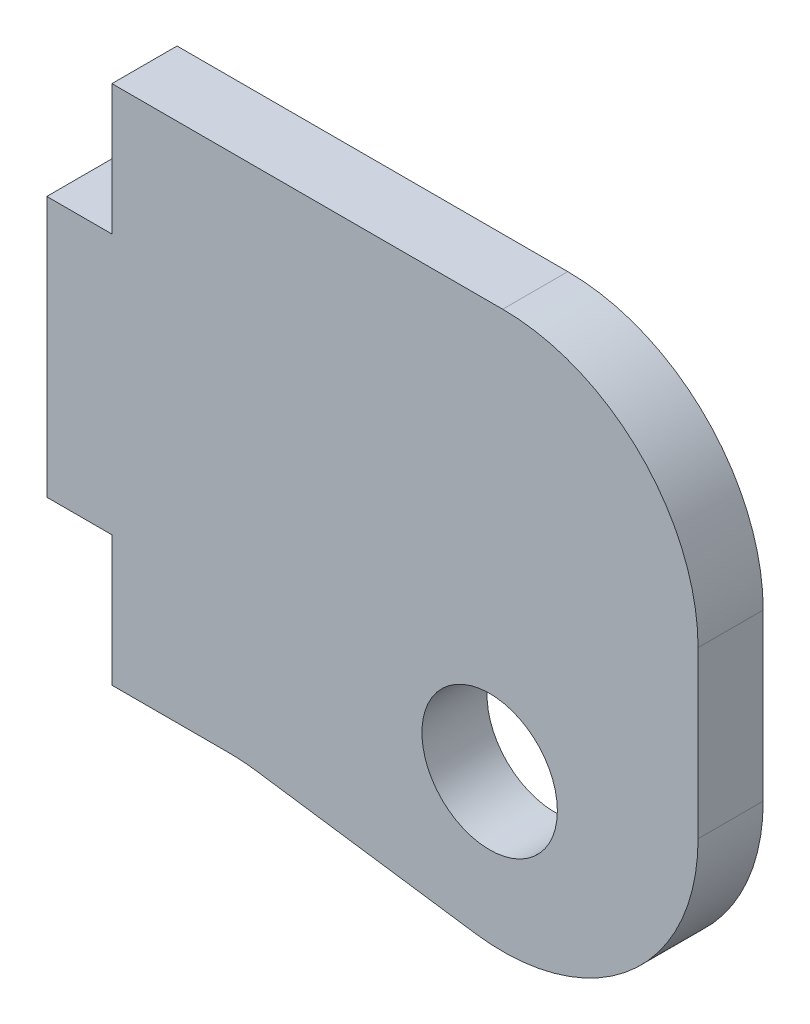
ISO-10303-21;
HEADER;
FILE_DESCRIPTION(('STEP AP214'),'2;1');
FILE_NAME('part.step','',(''),(''),'','','');
FILE_SCHEMA(('AUTOMOTIVE_DESIGN { 1 0 10303 214 1 1 1 1 }'));
ENDSEC;
DATA;
#1=APPLICATION_CONTEXT('core data for automotive mechanical design processes');
#2=APPLICATION_PROTOCOL_DEFINITION('international standard','automotive_design',2000,#1);
#3=PRODUCT_CONTEXT('',#1,'mechanical');
#4=PRODUCT('Part','Part','',(#3));
#5=PRODUCT_RELATED_PRODUCT_CATEGORY('part','',(#4));
#6=PRODUCT_DEFINITION_FORMATION('','',#4);
#7=PRODUCT_DEFINITION_CONTEXT('part definition',#1,'design');
#8=PRODUCT_DEFINITION('design','',#6,#7);
#9=PRODUCT_DEFINITION_SHAPE('','',#8);
#10=(LENGTH_UNIT() NAMED_UNIT(*) SI_UNIT(.MILLI.,.METRE.));
#11=(NAMED_UNIT(*) PLANE_ANGLE_UNIT() SI_UNIT($,.RADIAN.));
#12=(NAMED_UNIT(*) SI_UNIT($,.STERADIAN.) SOLID_ANGLE_UNIT());
#13=UNCERTAINTY_MEASURE_WITH_UNIT(LENGTH_MEASURE(1.E-05),#10,'distance_accuracy_value','');
#14=(GEOMETRIC_REPRESENTATION_CONTEXT(3) GLOBAL_UNCERTAINTY_ASSIGNED_CONTEXT((#13)) GLOBAL_UNIT_ASSIGNED_CONTEXT((#10,
#11,#12)) REPRESENTATION_CONTEXT('',''));
#15=CARTESIAN_POINT('',(0.,0.,0.));
#16=DIRECTION('',(0.,0.,1.));
#17=DIRECTION('',(1.,0.,0.));
#18=AXIS2_PLACEMENT_3D('',#15,#16,#17);
#19=CARTESIAN_POINT('',(31.75,12.7,3.175));
#20=DIRECTION('',(0.,-1.,0.));
#21=DIRECTION('',(1.,0.,0.));
#22=AXIS2_PLACEMENT_3D('',#19,#20,#21);
#23=PLANE('',#22);
#24=DIRECTION('',(-1.,0.,0.));
#25=VECTOR('',#24,1.);
#26=CARTESIAN_POINT('',(31.75,12.7,0.));
#27=LINE('',#26,#25);
#28=CARTESIAN_POINT('',(22.225,12.7,0.));
#29=VERTEX_POINT('',#28);
#30=CARTESIAN_POINT('',(3.175,12.7,0.));
#31=VERTEX_POINT('',#30);
#32=EDGE_CURVE('E151',#29,#31,#27,.T.);
#33=ORIENTED_EDGE('',*,*,#32,.T.);
#34=DIRECTION('',(0.,0.,1.));
#35=VECTOR('',#34,1.);
#36=CARTESIAN_POINT('',(3.175,12.7,0.));
#37=LINE('',#36,#35);
#38=CARTESIAN_POINT('',(3.175,12.7,3.175));
#39=VERTEX_POINT('',#38);
#40=EDGE_CURVE('E198',#31,#39,#37,.T.);
#41=ORIENTED_EDGE('',*,*,#40,.T.);
#42=DIRECTION('',(-1.,0.,0.));
#43=VECTOR('',#42,1.);
#44=CARTESIAN_POINT('',(31.75,12.7,3.175));
#45=LINE('',#44,#43);
#46=CARTESIAN_POINT('',(22.225,12.7,3.175));
#47=VERTEX_POINT('',#46);
#48=EDGE_CURVE('E157',#47,#39,#45,.T.);
#49=ORIENTED_EDGE('',*,*,#48,.F.);
#50=DIRECTION('',(0.,0.,-1.));
#51=VECTOR('',#50,1.);
#52=CARTESIAN_POINT('',(22.225,12.7,3.175));
#53=LINE('',#52,#51);
#54=EDGE_CURVE('E166',#47,#29,#53,.T.);
#55=ORIENTED_EDGE('',*,*,#54,.T.);
#56=EDGE_LOOP('',(#33,#41,#49,#55));
#57=FACE_BOUND('',#56,.T.);
#58=ADVANCED_FACE('F35',(#57),#23,.F.);
#59=CARTESIAN_POINT('',(0.,12.7,3.175));
#60=DIRECTION('',(1.,0.,0.));
#61=DIRECTION('',(0.,1.,0.));
#62=AXIS2_PLACEMENT_3D('',#59,#60,#61);
#63=PLANE('',#62);
#64=DIRECTION('',(0.,-1.,0.));
#65=VECTOR('',#64,1.);
#66=CARTESIAN_POINT('',(0.,12.7,0.));
#67=LINE('',#66,#65);
#68=CARTESIAN_POINT('',(0.,6.35000000000001,0.));
#69=VERTEX_POINT('',#68);
#70=CARTESIAN_POINT('',(0.,-6.34999999999999,0.));
#71=VERTEX_POINT('',#70);
#72=EDGE_CURVE('E145',#69,#71,#67,.T.);
#73=ORIENTED_EDGE('',*,*,#72,.T.);
#74=DIRECTION('',(0.,0.,1.));
#75=VECTOR('',#74,1.);
#76=CARTESIAN_POINT('',(0.,-6.34999999999999,0.));
#77=LINE('',#76,#75);
#78=CARTESIAN_POINT('',(0.,-6.34999999999999,3.175));
#79=VERTEX_POINT('',#78);
#80=EDGE_CURVE('E231',#71,#79,#77,.T.);
#81=ORIENTED_EDGE('',*,*,#80,.T.);
#82=DIRECTION('',(0.,-1.,0.));
#83=VECTOR('',#82,1.);
#84=CARTESIAN_POINT('',(0.,12.7,3.175));
#85=LINE('',#84,#83);
#86=CARTESIAN_POINT('',(0.,6.35000000000001,3.175));
#87=VERTEX_POINT('',#86);
#88=EDGE_CURVE('E199',#87,#79,#85,.T.);
#89=ORIENTED_EDGE('',*,*,#88,.F.);
#90=DIRECTION('',(0.,0.,1.));
#91=VECTOR('',#90,1.);
#92=CARTESIAN_POINT('',(0.,6.35000000000001,0.));
#93=LINE('',#92,#91);
#94=EDGE_CURVE('E234',#69,#87,#93,.T.);
#95=ORIENTED_EDGE('',*,*,#94,.F.);
#96=EDGE_LOOP('',(#73,#81,#89,#95));
#97=FACE_BOUND('',#96,.T.);
#98=ADVANCED_FACE('F256',(#97),#63,.F.);
#99=CARTESIAN_POINT('',(0.,-12.7,3.175));
#100=DIRECTION('',(0.,1.,0.));
#101=DIRECTION('',(-1.,0.,0.));
#102=AXIS2_PLACEMENT_3D('',#99,#100,#101);
#103=PLANE('',#102);
#104=DIRECTION('',(1.,0.,0.));
#105=VECTOR('',#104,1.);
#106=CARTESIAN_POINT('',(0.,-12.7,3.175));
#107=LINE('',#106,#105);
#108=CARTESIAN_POINT('',(3.175,-12.7,3.175));
#109=VERTEX_POINT('',#108);
#110=CARTESIAN_POINT('',(8.84807909198137,-12.7,3.175));
#111=VERTEX_POINT('',#110);
#112=EDGE_CURVE('E139',#109,#111,#107,.T.);
#113=ORIENTED_EDGE('',*,*,#112,.F.);
#114=DIRECTION('',(0.,0.,1.));
#115=VECTOR('',#114,1.);
#116=CARTESIAN_POINT('',(3.175,-12.7,0.));
#117=LINE('',#116,#115);
#118=CARTESIAN_POINT('',(3.175,-12.7,0.));
#119=VERTEX_POINT('',#118);
#120=EDGE_CURVE('E126',#119,#109,#117,.T.);
#121=ORIENTED_EDGE('',*,*,#120,.F.);
#122=DIRECTION('',(1.,0.,0.));
#123=VECTOR('',#122,1.);
#124=CARTESIAN_POINT('',(0.,-12.7,0.));
#125=LINE('',#124,#123);
#126=CARTESIAN_POINT('',(8.84807909198137,-12.7,0.));
#127=VERTEX_POINT('',#126);
#128=EDGE_CURVE('E137',#119,#127,#125,.T.);
#129=ORIENTED_EDGE('',*,*,#128,.T.);
#130=DIRECTION('',(0.,0.,-1.));
#131=VECTOR('',#130,1.);
#132=CARTESIAN_POINT('',(8.84807909198137,-12.7,3.175));
#133=LINE('',#132,#131);
#134=EDGE_CURVE('E164',#127,#111,#133,.F.);
#135=ORIENTED_EDGE('',*,*,#134,.T.);
#136=EDGE_LOOP('',(#113,#121,#129,#135));
#137=FACE_BOUND('',#136,.T.);
#138=ADVANCED_FACE('F135',(#137),#103,.F.);
#139=CARTESIAN_POINT('',(9.525,-12.7,3.175));
#140=DIRECTION('',(0.141421356237309,0.989949493661167,0.));
#141=DIRECTION('',(-0.989949493661167,0.141421356237309,0.));
#142=AXIS2_PLACEMENT_3D('',#139,#140,#141);
#143=PLANE('',#142);
#144=DIRECTION('',(0.989949493661167,-0.141421356237309,0.));
#145=VECTOR('',#144,1.);
#146=CARTESIAN_POINT('',(9.525,-12.7,3.175));
#147=LINE('',#146,#145);
#148=CARTESIAN_POINT('',(10.1951175101417,-12.7957310728774,3.175));
#149=VERTEX_POINT('',#148);
#150=CARTESIAN_POINT('',(20.8779615818396,-14.3218516545485,3.175));
#151=VERTEX_POINT('',#150);
#152=EDGE_CURVE('E214',#149,#151,#147,.T.);
#153=ORIENTED_EDGE('',*,*,#152,.F.);
#154=DIRECTION('',(0.,0.,-1.));
#155=VECTOR('',#154,1.);
#156=CARTESIAN_POINT('',(10.1951175101417,-12.7957310728774,0.));
#157=LINE('',#156,#155);
#158=CARTESIAN_POINT('',(10.1951175101417,-12.7957310728774,0.));
#159=VERTEX_POINT('',#158);
#160=EDGE_CURVE('E160',#149,#159,#157,.T.);
#161=ORIENTED_EDGE('',*,*,#160,.T.);
#162=DIRECTION('',(0.989949493661167,-0.141421356237309,0.));
#163=VECTOR('',#162,1.);
#164=CARTESIAN_POINT('',(9.525,-12.7,0.));
#165=LINE('',#164,#163);
#166=CARTESIAN_POINT('',(20.8779615818396,-14.3218516545485,0.));
#167=VERTEX_POINT('',#166);
#168=EDGE_CURVE('E144',#159,#167,#165,.T.);
#169=ORIENTED_EDGE('',*,*,#168,.T.);
#170=DIRECTION('',(0.,0.,-1.));
#171=VECTOR('',#170,1.);
#172=CARTESIAN_POINT('',(20.8779615818396,-14.3218516545485,3.175));
#173=LINE('',#172,#171);
#174=EDGE_CURVE('E158',#167,#151,#173,.F.);
#175=ORIENTED_EDGE('',*,*,#174,.T.);
#176=EDGE_LOOP('',(#153,#161,#169,#175));
#177=FACE_BOUND('',#176,.T.);
#178=ADVANCED_FACE('F211',(#177),#143,.F.);
#179=CARTESIAN_POINT('',(31.75,-15.875,3.175));
#180=DIRECTION('',(-1.,0.,0.));
#181=DIRECTION('',(0.,-1.,0.));
#182=AXIS2_PLACEMENT_3D('',#179,#180,#181);
#183=PLANE('',#182);
#184=DIRECTION('',(0.,1.,0.));
#185=VECTOR('',#184,1.);
#186=CARTESIAN_POINT('',(31.75,-15.875,0.));
#187=LINE('',#186,#185);
#188=CARTESIAN_POINT('',(31.75,-4.8925827274259,0.));
#189=VERTEX_POINT('',#188);
#190=CARTESIAN_POINT('',(31.75,3.17500000000001,0.));
#191=VERTEX_POINT('',#190);
#192=EDGE_CURVE('E148',#189,#191,#187,.T.);
#193=ORIENTED_EDGE('',*,*,#192,.T.);
#194=DIRECTION('',(0.,0.,-1.));
#195=VECTOR('',#194,1.);
#196=CARTESIAN_POINT('',(31.75,3.17500000000001,3.175));
#197=LINE('',#196,#195);
#198=CARTESIAN_POINT('',(31.75,3.17500000000001,3.175));
#199=VERTEX_POINT('',#198);
#200=EDGE_CURVE('E176',#191,#199,#197,.F.);
#201=ORIENTED_EDGE('',*,*,#200,.T.);
#202=DIRECTION('',(0.,1.,0.));
#203=VECTOR('',#202,1.);
#204=CARTESIAN_POINT('',(31.75,-15.875,3.175));
#205=LINE('',#204,#203);
#206=CARTESIAN_POINT('',(31.75,-4.8925827274259,3.175));
#207=VERTEX_POINT('',#206);
#208=EDGE_CURVE('E161',#207,#199,#205,.T.);
#209=ORIENTED_EDGE('',*,*,#208,.F.);
#210=DIRECTION('',(0.,0.,-1.));
#211=VECTOR('',#210,1.);
#212=CARTESIAN_POINT('',(31.75,-4.8925827274259,3.175));
#213=LINE('',#212,#211);
#214=EDGE_CURVE('E173',#207,#189,#213,.T.);
#215=ORIENTED_EDGE('',*,*,#214,.T.);
#216=EDGE_LOOP('',(#193,#201,#209,#215));
#217=FACE_BOUND('',#216,.T.);
#218=ADVANCED_FACE('F204',(#217),#183,.F.);
#219=CARTESIAN_POINT('',(0.,0.,3.175));
#220=DIRECTION('',(0.,0.,1.));
#221=DIRECTION('',(1.,0.,0.));
#222=AXIS2_PLACEMENT_3D('',#219,#220,#221);
#223=PLANE('',#222);
#224=DIRECTION('',(-1.,0.,0.));
#225=VECTOR('',#224,1.);
#226=CARTESIAN_POINT('',(0.,-6.34999999999999,3.175));
#227=LINE('',#226,#225);
#228=CARTESIAN_POINT('',(3.175,-6.34999999999999,3.175));
#229=VERTEX_POINT('',#228);
#230=EDGE_CURVE('E131',#229,#79,#227,.T.);
#231=ORIENTED_EDGE('',*,*,#230,.F.);
#232=DIRECTION('',(0.,1.,0.));
#233=VECTOR('',#232,1.);
#234=CARTESIAN_POINT('',(3.175,-12.7,3.175));
#235=LINE('',#234,#233);
#236=EDGE_CURVE('E218',#109,#229,#235,.T.);
#237=ORIENTED_EDGE('',*,*,#236,.F.);
#238=ORIENTED_EDGE('',*,*,#112,.T.);
#239=CARTESIAN_POINT('',(8.84807909198136,-22.225,3.175));
#240=DIRECTION('',(0.,0.,1.));
#241=DIRECTION('',(1.,0.,0.));
#242=AXIS2_PLACEMENT_3D('',#239,#240,#241);
#243=CIRCLE('',#242,9.525);
#244=EDGE_CURVE('E11',#111,#149,#243,.F.);
#245=ORIENTED_EDGE('',*,*,#244,.T.);
#246=ORIENTED_EDGE('',*,*,#152,.T.);
#247=CARTESIAN_POINT('',(22.225,-4.8925827274259,3.175));
#248=DIRECTION('',(0.,0.,1.));
#249=DIRECTION('',(1.,0.,0.));
#250=AXIS2_PLACEMENT_3D('',#247,#248,#249);
#251=CIRCLE('',#250,9.525);
#252=EDGE_CURVE('E178',#151,#207,#251,.T.);
#253=ORIENTED_EDGE('',*,*,#252,.T.);
#254=ORIENTED_EDGE('',*,*,#208,.T.);
#255=CARTESIAN_POINT('',(22.225,3.17500000000001,3.175));
#256=DIRECTION('',(0.,0.,1.));
#257=DIRECTION('',(1.,0.,0.));
#258=AXIS2_PLACEMENT_3D('',#255,#256,#257);
#259=CIRCLE('',#258,9.525);
#260=EDGE_CURVE('E180',#199,#47,#259,.T.);
#261=ORIENTED_EDGE('',*,*,#260,.T.);
#262=ORIENTED_EDGE('',*,*,#48,.T.);
#263=DIRECTION('',(0.,1.,0.));
#264=VECTOR('',#263,1.);
#265=CARTESIAN_POINT('',(3.175,12.7,3.175));
#266=LINE('',#265,#264);
#267=CARTESIAN_POINT('',(3.175,6.35000000000001,3.175));
#268=VERTEX_POINT('',#267);
#269=EDGE_CURVE('E239',#268,#39,#266,.T.);
#270=ORIENTED_EDGE('',*,*,#269,.F.);
#271=DIRECTION('',(1.,0.,0.));
#272=VECTOR('',#271,1.);
#273=CARTESIAN_POINT('',(0.,6.35000000000001,3.175));
#274=LINE('',#273,#272);
#275=EDGE_CURVE('E242',#87,#268,#274,.T.);
#276=ORIENTED_EDGE('',*,*,#275,.F.);
#277=ORIENTED_EDGE('',*,*,#88,.T.);
#278=EDGE_LOOP('',(#231,#237,#238,#245,#246,#253,#254,#261,#262,#270,#276,#277));
#279=FACE_BOUND('',#278,.T.);
#280=CARTESIAN_POINT('',(21.5882999780113,-7.14087159890308,3.175));
#281=DIRECTION('',(0.,0.,1.));
#282=DIRECTION('',(1.,0.,0.));
#283=AXIS2_PLACEMENT_3D('',#280,#281,#282);
#284=CIRCLE('',#283,3.302);
#285=CARTESIAN_POINT('',(24.8902999780113,-7.14087159890308,3.175));
#286=VERTEX_POINT('',#285);
#287=EDGE_CURVE('E226',#286,#286,#284,.T.);
#288=ORIENTED_EDGE('',*,*,#287,.F.);
#289=EDGE_LOOP('',(#288));
#290=FACE_BOUND('',#289,.T.);
#291=ADVANCED_FACE('F187',(#279,#290),#223,.T.);
#292=CARTESIAN_POINT('',(0.,0.,0.));
#293=DIRECTION('',(0.,0.,1.));
#294=DIRECTION('',(1.,0.,0.));
#295=AXIS2_PLACEMENT_3D('',#292,#293,#294);
#296=PLANE('',#295);
#297=CARTESIAN_POINT('',(21.5882999780113,-7.14087159890308,0.));
#298=DIRECTION('',(0.,0.,1.));
#299=DIRECTION('',(1.,0.,0.));
#300=AXIS2_PLACEMENT_3D('',#297,#298,#299);
#301=CIRCLE('',#300,3.302);
#302=CARTESIAN_POINT('',(24.8902999780113,-7.14087159890308,0.));
#303=VERTEX_POINT('',#302);
#304=EDGE_CURVE('E224',#303,#303,#301,.T.);
#305=ORIENTED_EDGE('',*,*,#304,.T.);
#306=EDGE_LOOP('',(#305));
#307=FACE_BOUND('',#306,.T.);
#308=DIRECTION('',(0.,1.,0.));
#309=VECTOR('',#308,1.);
#310=CARTESIAN_POINT('',(3.175,-12.7,0.));
#311=LINE('',#310,#309);
#312=CARTESIAN_POINT('',(3.175,-6.34999999999999,0.));
#313=VERTEX_POINT('',#312);
#314=EDGE_CURVE('E122',#119,#313,#311,.T.);
#315=ORIENTED_EDGE('',*,*,#314,.T.);
#316=DIRECTION('',(-1.,0.,0.));
#317=VECTOR('',#316,1.);
#318=CARTESIAN_POINT('',(0.,-6.34999999999999,0.));
#319=LINE('',#318,#317);
#320=EDGE_CURVE('E50',#313,#71,#319,.T.);
#321=ORIENTED_EDGE('',*,*,#320,.T.);
#322=ORIENTED_EDGE('',*,*,#72,.F.);
#323=DIRECTION('',(1.,0.,0.));
#324=VECTOR('',#323,1.);
#325=CARTESIAN_POINT('',(0.,6.35000000000001,0.));
#326=LINE('',#325,#324);
#327=CARTESIAN_POINT('',(3.175,6.35000000000001,0.));
#328=VERTEX_POINT('',#327);
#329=EDGE_CURVE('E241',#69,#328,#326,.T.);
#330=ORIENTED_EDGE('',*,*,#329,.T.);
#331=DIRECTION('',(0.,1.,0.));
#332=VECTOR('',#331,1.);
#333=CARTESIAN_POINT('',(3.175,12.7,0.));
#334=LINE('',#333,#332);
#335=EDGE_CURVE('E58',#328,#31,#334,.T.);
#336=ORIENTED_EDGE('',*,*,#335,.T.);
#337=ORIENTED_EDGE('',*,*,#32,.F.);
#338=CARTESIAN_POINT('',(22.225,3.17500000000001,0.));
#339=DIRECTION('',(0.,0.,1.));
#340=DIRECTION('',(1.,0.,0.));
#341=AXIS2_PLACEMENT_3D('',#338,#339,#340);
#342=CIRCLE('',#341,9.525);
#343=EDGE_CURVE('E171',#29,#191,#342,.F.);
#344=ORIENTED_EDGE('',*,*,#343,.T.);
#345=ORIENTED_EDGE('',*,*,#192,.F.);
#346=CARTESIAN_POINT('',(22.225,-4.8925827274259,0.));
#347=DIRECTION('',(0.,0.,1.));
#348=DIRECTION('',(1.,0.,0.));
#349=AXIS2_PLACEMENT_3D('',#346,#347,#348);
#350=CIRCLE('',#349,9.525);
#351=EDGE_CURVE('E169',#189,#167,#350,.F.);
#352=ORIENTED_EDGE('',*,*,#351,.T.);
#353=ORIENTED_EDGE('',*,*,#168,.F.);
#354=CARTESIAN_POINT('',(8.84807909198136,-22.225,0.));
#355=DIRECTION('',(0.,0.,1.));
#356=DIRECTION('',(1.,0.,0.));
#357=AXIS2_PLACEMENT_3D('',#354,#355,#356);
#358=CIRCLE('',#357,9.525);
#359=EDGE_CURVE('E43',#159,#127,#358,.T.);
#360=ORIENTED_EDGE('',*,*,#359,.T.);
#361=ORIENTED_EDGE('',*,*,#128,.F.);
#362=EDGE_LOOP('',(#315,#321,#322,#330,#336,#337,#344,#345,#352,#353,#360,#361));
#363=FACE_BOUND('',#362,.T.);
#364=ADVANCED_FACE('F141',(#307,#363),#296,.F.);
#365=CARTESIAN_POINT('',(21.5882999780113,-7.14087159890308,0.));
#366=DIRECTION('',(0.,0.,1.));
#367=DIRECTION('',(1.,0.,0.));
#368=AXIS2_PLACEMENT_3D('',#365,#366,#367);
#369=CYLINDRICAL_SURFACE('',#368,3.302);
#370=ORIENTED_EDGE('',*,*,#304,.F.);
#371=EDGE_LOOP('',(#370));
#372=FACE_BOUND('',#371,.T.);
#373=ORIENTED_EDGE('',*,*,#287,.T.);
#374=EDGE_LOOP('',(#373));
#375=FACE_BOUND('',#374,.T.);
#376=ADVANCED_FACE('F280',(#372,#375),#369,.F.);
#377=CARTESIAN_POINT('',(8.84807909198136,-22.225,3.175));
#378=DIRECTION('',(0.,0.,1.));
#379=DIRECTION('',(1.,0.,0.));
#380=AXIS2_PLACEMENT_3D('',#377,#378,#379);
#381=CYLINDRICAL_SURFACE('',#380,9.525);
#382=ORIENTED_EDGE('',*,*,#244,.F.);
#383=ORIENTED_EDGE('',*,*,#134,.F.);
#384=ORIENTED_EDGE('',*,*,#359,.F.);
#385=ORIENTED_EDGE('',*,*,#160,.F.);
#386=EDGE_LOOP('',(#382,#383,#384,#385));
#387=FACE_BOUND('',#386,.T.);
#388=ADVANCED_FACE('F217',(#387),#381,.F.);
#389=CARTESIAN_POINT('',(22.225,3.17500000000001,3.175));
#390=DIRECTION('',(0.,0.,-1.));
#391=DIRECTION('',(-1.,0.,0.));
#392=AXIS2_PLACEMENT_3D('',#389,#390,#391);
#393=CYLINDRICAL_SURFACE('',#392,9.525);
#394=ORIENTED_EDGE('',*,*,#260,.F.);
#395=ORIENTED_EDGE('',*,*,#200,.F.);
#396=ORIENTED_EDGE('',*,*,#343,.F.);
#397=ORIENTED_EDGE('',*,*,#54,.F.);
#398=EDGE_LOOP('',(#394,#395,#396,#397));
#399=FACE_BOUND('',#398,.T.);
#400=ADVANCED_FACE('F201',(#399),#393,.T.);
#401=CARTESIAN_POINT('',(22.225,-4.8925827274259,3.175));
#402=DIRECTION('',(0.,0.,-1.));
#403=DIRECTION('',(-1.,0.,0.));
#404=AXIS2_PLACEMENT_3D('',#401,#402,#403);
#405=CYLINDRICAL_SURFACE('',#404,9.525);
#406=ORIENTED_EDGE('',*,*,#252,.F.);
#407=ORIENTED_EDGE('',*,*,#174,.F.);
#408=ORIENTED_EDGE('',*,*,#351,.F.);
#409=ORIENTED_EDGE('',*,*,#214,.F.);
#410=EDGE_LOOP('',(#406,#407,#408,#409));
#411=FACE_BOUND('',#410,.T.);
#412=ADVANCED_FACE('F37',(#411),#405,.T.);
#413=CARTESIAN_POINT('',(3.175,12.7,0.));
#414=DIRECTION('',(1.,0.,0.));
#415=DIRECTION('',(0.,1.,0.));
#416=AXIS2_PLACEMENT_3D('',#413,#414,#415);
#417=PLANE('',#416);
#418=ORIENTED_EDGE('',*,*,#269,.T.);
#419=ORIENTED_EDGE('',*,*,#40,.F.);
#420=ORIENTED_EDGE('',*,*,#335,.F.);
#421=DIRECTION('',(0.,0.,1.));
#422=VECTOR('',#421,1.);
#423=CARTESIAN_POINT('',(3.175,6.35000000000001,0.));
#424=LINE('',#423,#422);
#425=EDGE_CURVE('E236',#328,#268,#424,.T.);
#426=ORIENTED_EDGE('',*,*,#425,.T.);
#427=EDGE_LOOP('',(#418,#419,#420,#426));
#428=FACE_BOUND('',#427,.T.);
#429=ADVANCED_FACE('F261',(#428),#417,.F.);
#430=CARTESIAN_POINT('',(0.,6.35000000000001,0.));
#431=DIRECTION('',(0.,-1.,0.));
#432=DIRECTION('',(0.,0.,-1.));
#433=AXIS2_PLACEMENT_3D('',#430,#431,#432);
#434=PLANE('',#433);
#435=ORIENTED_EDGE('',*,*,#275,.T.);
#436=ORIENTED_EDGE('',*,*,#425,.F.);
#437=ORIENTED_EDGE('',*,*,#329,.F.);
#438=ORIENTED_EDGE('',*,*,#94,.T.);
#439=EDGE_LOOP('',(#435,#436,#437,#438));
#440=FACE_BOUND('',#439,.T.);
#441=ADVANCED_FACE('F260',(#440),#434,.F.);
#442=CARTESIAN_POINT('',(0.,-6.34999999999999,0.));
#443=DIRECTION('',(0.,1.,0.));
#444=DIRECTION('',(0.,0.,1.));
#445=AXIS2_PLACEMENT_3D('',#442,#443,#444);
#446=PLANE('',#445);
#447=ORIENTED_EDGE('',*,*,#230,.T.);
#448=ORIENTED_EDGE('',*,*,#80,.F.);
#449=ORIENTED_EDGE('',*,*,#320,.F.);
#450=DIRECTION('',(0.,0.,1.));
#451=VECTOR('',#450,1.);
#452=CARTESIAN_POINT('',(3.175,-6.34999999999999,0.));
#453=LINE('',#452,#451);
#454=EDGE_CURVE('E128',#313,#229,#453,.T.);
#455=ORIENTED_EDGE('',*,*,#454,.T.);
#456=EDGE_LOOP('',(#447,#448,#449,#455));
#457=FACE_BOUND('',#456,.T.);
#458=ADVANCED_FACE('F268',(#457),#446,.F.);
#459=CARTESIAN_POINT('',(3.175,-12.7,0.));
#460=DIRECTION('',(1.,0.,0.));
#461=DIRECTION('',(0.,0.,-1.));
#462=AXIS2_PLACEMENT_3D('',#459,#460,#461);
#463=PLANE('',#462);
#464=ORIENTED_EDGE('',*,*,#236,.T.);
#465=ORIENTED_EDGE('',*,*,#454,.F.);
#466=ORIENTED_EDGE('',*,*,#314,.F.);
#467=ORIENTED_EDGE('',*,*,#120,.T.);
#468=EDGE_LOOP('',(#464,#465,#466,#467));
#469=FACE_BOUND('',#468,.T.);
#470=ADVANCED_FACE('F125',(#469),#463,.F.);
#471=CLOSED_SHELL('',(#58,#98,#138,#178,#218,#291,#364,#376,#388,#400,#412,#429,#441,#458,#470));
#472=MANIFOLD_SOLID_BREP('B2',#471);
#473=ADVANCED_BREP_SHAPE_REPRESENTATION('',(#18,#472),#14);
#474=SHAPE_DEFINITION_REPRESENTATION(#9,#473);
ENDSEC;
END-ISO-10303-21;
